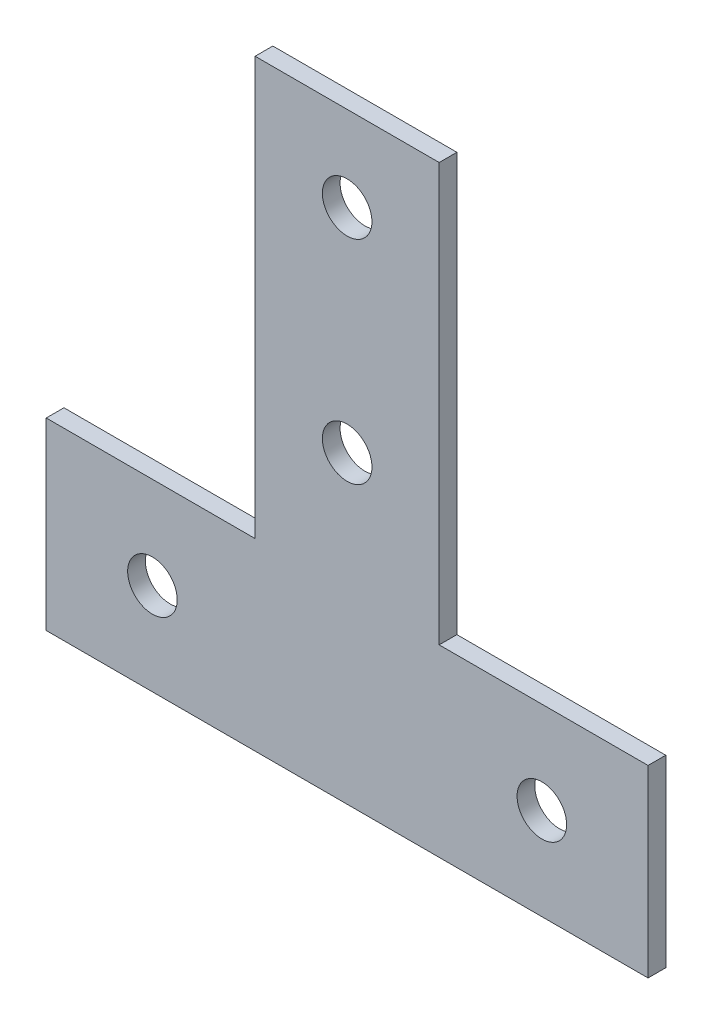
ISO-10303-21;
HEADER;
FILE_DESCRIPTION(('STEP AP214'),'2;1');
FILE_NAME('part.step','',(''),(''),'','','');
FILE_SCHEMA(('AUTOMOTIVE_DESIGN { 1 0 10303 214 1 1 1 1 }'));
ENDSEC;
DATA;
#1=APPLICATION_CONTEXT('core data for automotive mechanical design processes');
#2=APPLICATION_PROTOCOL_DEFINITION('international standard','automotive_design',2000,#1);
#3=PRODUCT_CONTEXT('',#1,'mechanical');
#4=PRODUCT('Part','Part','',(#3));
#5=PRODUCT_RELATED_PRODUCT_CATEGORY('part','',(#4));
#6=PRODUCT_DEFINITION_FORMATION('','',#4);
#7=PRODUCT_DEFINITION_CONTEXT('part definition',#1,'design');
#8=PRODUCT_DEFINITION('design','',#6,#7);
#9=PRODUCT_DEFINITION_SHAPE('','',#8);
#10=(LENGTH_UNIT() NAMED_UNIT(*) SI_UNIT(.MILLI.,.METRE.));
#11=(NAMED_UNIT(*) PLANE_ANGLE_UNIT() SI_UNIT($,.RADIAN.));
#12=(NAMED_UNIT(*) SI_UNIT($,.STERADIAN.) SOLID_ANGLE_UNIT());
#13=UNCERTAINTY_MEASURE_WITH_UNIT(LENGTH_MEASURE(1.E-05),#10,'distance_accuracy_value','');
#14=(GEOMETRIC_REPRESENTATION_CONTEXT(3) GLOBAL_UNCERTAINTY_ASSIGNED_CONTEXT((#13)) GLOBAL_UNIT_ASSIGNED_CONTEXT((#10,
#11,#12)) REPRESENTATION_CONTEXT('',''));
#15=CARTESIAN_POINT('',(0.,0.,0.));
#16=DIRECTION('',(0.,0.,1.));
#17=DIRECTION('',(1.,0.,0.));
#18=AXIS2_PLACEMENT_3D('',#15,#16,#17);
#19=CARTESIAN_POINT('',(0.,0.,2.5));
#20=DIRECTION('',(0.,0.,1.));
#21=DIRECTION('',(1.,0.,0.));
#22=AXIS2_PLACEMENT_3D('',#19,#20,#21);
#23=PLANE('',#22);
#24=CARTESIAN_POINT('',(-27.5,13.,2.5));
#25=DIRECTION('',(0.,0.,1.));
#26=DIRECTION('',(1.,0.,0.));
#27=AXIS2_PLACEMENT_3D('',#24,#25,#26);
#28=CIRCLE('',#27,3.5);
#29=CARTESIAN_POINT('',(-24.,13.,2.5));
#30=VERTEX_POINT('',#29);
#31=EDGE_CURVE('E189',#30,#30,#28,.T.);
#32=ORIENTED_EDGE('',*,*,#31,.F.);
#33=EDGE_LOOP('',(#32));
#34=FACE_BOUND('',#33,.T.);
#35=CARTESIAN_POINT('',(0.,73.,2.5));
#36=DIRECTION('',(0.,0.,1.));
#37=DIRECTION('',(1.,0.,0.));
#38=AXIS2_PLACEMENT_3D('',#35,#36,#37);
#39=CIRCLE('',#38,3.5);
#40=CARTESIAN_POINT('',(3.5,73.,2.5));
#41=VERTEX_POINT('',#40);
#42=EDGE_CURVE('E135',#41,#41,#39,.T.);
#43=ORIENTED_EDGE('',*,*,#42,.F.);
#44=EDGE_LOOP('',(#43));
#45=FACE_BOUND('',#44,.T.);
#46=DIRECTION('',(0.,1.,0.));
#47=VECTOR('',#46,1.);
#48=CARTESIAN_POINT('',(42.5,26.,2.5));
#49=LINE('',#48,#47);
#50=CARTESIAN_POINT('',(42.5,0.,2.5));
#51=VERTEX_POINT('',#50);
#52=CARTESIAN_POINT('',(42.5,26.,2.5));
#53=VERTEX_POINT('',#52);
#54=EDGE_CURVE('E146',#51,#53,#49,.T.);
#55=ORIENTED_EDGE('',*,*,#54,.T.);
#56=DIRECTION('',(-1.,0.,0.));
#57=VECTOR('',#56,1.);
#58=CARTESIAN_POINT('',(13.,26.,2.5));
#59=LINE('',#58,#57);
#60=CARTESIAN_POINT('',(13.,26.,2.5));
#61=VERTEX_POINT('',#60);
#62=EDGE_CURVE('E94',#53,#61,#59,.T.);
#63=ORIENTED_EDGE('',*,*,#62,.T.);
#64=DIRECTION('',(0.,1.,0.));
#65=VECTOR('',#64,1.);
#66=CARTESIAN_POINT('',(13.,85.,2.5));
#67=LINE('',#66,#65);
#68=CARTESIAN_POINT('',(13.,85.,2.5));
#69=VERTEX_POINT('',#68);
#70=EDGE_CURVE('E161',#61,#69,#67,.T.);
#71=ORIENTED_EDGE('',*,*,#70,.T.);
#72=DIRECTION('',(-1.,0.,0.));
#73=VECTOR('',#72,1.);
#74=CARTESIAN_POINT('',(-13.,85.,2.5));
#75=LINE('',#74,#73);
#76=CARTESIAN_POINT('',(-13.,85.,2.5));
#77=VERTEX_POINT('',#76);
#78=EDGE_CURVE('E174',#69,#77,#75,.T.);
#79=ORIENTED_EDGE('',*,*,#78,.T.);
#80=DIRECTION('',(0.,-1.,0.));
#81=VECTOR('',#80,1.);
#82=CARTESIAN_POINT('',(-13.,26.,2.5));
#83=LINE('',#82,#81);
#84=CARTESIAN_POINT('',(-13.,26.,2.5));
#85=VERTEX_POINT('',#84);
#86=EDGE_CURVE('E113',#77,#85,#83,.T.);
#87=ORIENTED_EDGE('',*,*,#86,.T.);
#88=DIRECTION('',(-1.,0.,0.));
#89=VECTOR('',#88,1.);
#90=CARTESIAN_POINT('',(-42.5,26.,2.5));
#91=LINE('',#90,#89);
#92=CARTESIAN_POINT('',(-42.5,26.,2.5));
#93=VERTEX_POINT('',#92);
#94=EDGE_CURVE('E107',#85,#93,#91,.T.);
#95=ORIENTED_EDGE('',*,*,#94,.T.);
#96=DIRECTION('',(0.,-1.,0.));
#97=VECTOR('',#96,1.);
#98=CARTESIAN_POINT('',(-42.5,0.,2.5));
#99=LINE('',#98,#97);
#100=CARTESIAN_POINT('',(-42.5,0.,2.5));
#101=VERTEX_POINT('',#100);
#102=EDGE_CURVE('E111',#93,#101,#99,.T.);
#103=ORIENTED_EDGE('',*,*,#102,.T.);
#104=DIRECTION('',(1.,0.,0.));
#105=VECTOR('',#104,1.);
#106=CARTESIAN_POINT('',(-42.5,0.,2.5));
#107=LINE('',#106,#105);
#108=EDGE_CURVE('E51',#101,#51,#107,.T.);
#109=ORIENTED_EDGE('',*,*,#108,.T.);
#110=EDGE_LOOP('',(#55,#63,#71,#79,#87,#95,#103,#109));
#111=FACE_BOUND('',#110,.T.);
#112=CARTESIAN_POINT('',(0.,43.,2.5));
#113=DIRECTION('',(0.,0.,1.));
#114=DIRECTION('',(1.,0.,0.));
#115=AXIS2_PLACEMENT_3D('',#112,#113,#114);
#116=CIRCLE('',#115,3.5);
#117=CARTESIAN_POINT('',(3.5,43.,2.5));
#118=VERTEX_POINT('',#117);
#119=EDGE_CURVE('E183',#118,#118,#116,.T.);
#120=ORIENTED_EDGE('',*,*,#119,.F.);
#121=EDGE_LOOP('',(#120));
#122=FACE_BOUND('',#121,.T.);
#123=CARTESIAN_POINT('',(27.5,13.,2.5));
#124=DIRECTION('',(0.,0.,1.));
#125=DIRECTION('',(1.,0.,0.));
#126=AXIS2_PLACEMENT_3D('',#123,#124,#125);
#127=CIRCLE('',#126,3.5);
#128=CARTESIAN_POINT('',(31.,13.,2.5));
#129=VERTEX_POINT('',#128);
#130=EDGE_CURVE('E195',#129,#129,#127,.T.);
#131=ORIENTED_EDGE('',*,*,#130,.F.);
#132=EDGE_LOOP('',(#131));
#133=FACE_BOUND('',#132,.T.);
#134=ADVANCED_FACE('F34',(#34,#45,#111,#122,#133),#23,.T.);
#135=CARTESIAN_POINT('',(0.,0.,0.));
#136=DIRECTION('',(0.,0.,1.));
#137=DIRECTION('',(1.,0.,0.));
#138=AXIS2_PLACEMENT_3D('',#135,#136,#137);
#139=PLANE('',#138);
#140=DIRECTION('',(0.,1.,0.));
#141=VECTOR('',#140,1.);
#142=CARTESIAN_POINT('',(42.5,26.,0.));
#143=LINE('',#142,#141);
#144=CARTESIAN_POINT('',(42.5,0.,0.));
#145=VERTEX_POINT('',#144);
#146=CARTESIAN_POINT('',(42.5,26.,0.));
#147=VERTEX_POINT('',#146);
#148=EDGE_CURVE('E131',#145,#147,#143,.T.);
#149=ORIENTED_EDGE('',*,*,#148,.F.);
#150=DIRECTION('',(1.,0.,0.));
#151=VECTOR('',#150,1.);
#152=CARTESIAN_POINT('',(-42.5,0.,0.));
#153=LINE('',#152,#151);
#154=CARTESIAN_POINT('',(-42.5,0.,0.));
#155=VERTEX_POINT('',#154);
#156=EDGE_CURVE('E86',#155,#145,#153,.T.);
#157=ORIENTED_EDGE('',*,*,#156,.F.);
#158=DIRECTION('',(0.,-1.,0.));
#159=VECTOR('',#158,1.);
#160=CARTESIAN_POINT('',(-42.5,0.,0.));
#161=LINE('',#160,#159);
#162=CARTESIAN_POINT('',(-42.5,26.,0.));
#163=VERTEX_POINT('',#162);
#164=EDGE_CURVE('E80',#163,#155,#161,.T.);
#165=ORIENTED_EDGE('',*,*,#164,.F.);
#166=DIRECTION('',(-1.,0.,0.));
#167=VECTOR('',#166,1.);
#168=CARTESIAN_POINT('',(-42.5,26.,0.));
#169=LINE('',#168,#167);
#170=CARTESIAN_POINT('',(-13.,26.,0.));
#171=VERTEX_POINT('',#170);
#172=EDGE_CURVE('E121',#171,#163,#169,.T.);
#173=ORIENTED_EDGE('',*,*,#172,.F.);
#174=DIRECTION('',(0.,-1.,0.));
#175=VECTOR('',#174,1.);
#176=CARTESIAN_POINT('',(-13.,26.,0.));
#177=LINE('',#176,#175);
#178=CARTESIAN_POINT('',(-13.,85.,0.));
#179=VERTEX_POINT('',#178);
#180=EDGE_CURVE('E141',#179,#171,#177,.T.);
#181=ORIENTED_EDGE('',*,*,#180,.F.);
#182=DIRECTION('',(-1.,0.,0.));
#183=VECTOR('',#182,1.);
#184=CARTESIAN_POINT('',(-13.,85.,0.));
#185=LINE('',#184,#183);
#186=CARTESIAN_POINT('',(13.,85.,0.));
#187=VERTEX_POINT('',#186);
#188=EDGE_CURVE('E139',#187,#179,#185,.T.);
#189=ORIENTED_EDGE('',*,*,#188,.F.);
#190=DIRECTION('',(0.,1.,0.));
#191=VECTOR('',#190,1.);
#192=CARTESIAN_POINT('',(13.,85.,0.));
#193=LINE('',#192,#191);
#194=CARTESIAN_POINT('',(13.,26.,0.));
#195=VERTEX_POINT('',#194);
#196=EDGE_CURVE('E137',#195,#187,#193,.T.);
#197=ORIENTED_EDGE('',*,*,#196,.F.);
#198=DIRECTION('',(-1.,0.,0.));
#199=VECTOR('',#198,1.);
#200=CARTESIAN_POINT('',(13.,26.,0.));
#201=LINE('',#200,#199);
#202=EDGE_CURVE('E134',#147,#195,#201,.T.);
#203=ORIENTED_EDGE('',*,*,#202,.F.);
#204=EDGE_LOOP('',(#149,#157,#165,#173,#181,#189,#197,#203));
#205=FACE_BOUND('',#204,.T.);
#206=CARTESIAN_POINT('',(0.,73.,0.));
#207=DIRECTION('',(0.,0.,1.));
#208=DIRECTION('',(1.,0.,0.));
#209=AXIS2_PLACEMENT_3D('',#206,#207,#208);
#210=CIRCLE('',#209,3.5);
#211=CARTESIAN_POINT('',(3.5,73.,0.));
#212=VERTEX_POINT('',#211);
#213=EDGE_CURVE('E180',#212,#212,#210,.T.);
#214=ORIENTED_EDGE('',*,*,#213,.T.);
#215=EDGE_LOOP('',(#214));
#216=FACE_BOUND('',#215,.T.);
#217=CARTESIAN_POINT('',(0.,43.,0.));
#218=DIRECTION('',(0.,0.,1.));
#219=DIRECTION('',(1.,0.,0.));
#220=AXIS2_PLACEMENT_3D('',#217,#218,#219);
#221=CIRCLE('',#220,3.5);
#222=CARTESIAN_POINT('',(3.5,43.,0.));
#223=VERTEX_POINT('',#222);
#224=EDGE_CURVE('E186',#223,#223,#221,.T.);
#225=ORIENTED_EDGE('',*,*,#224,.T.);
#226=EDGE_LOOP('',(#225));
#227=FACE_BOUND('',#226,.T.);
#228=CARTESIAN_POINT('',(-27.5,13.,0.));
#229=DIRECTION('',(0.,0.,1.));
#230=DIRECTION('',(1.,0.,0.));
#231=AXIS2_PLACEMENT_3D('',#228,#229,#230);
#232=CIRCLE('',#231,3.5);
#233=CARTESIAN_POINT('',(-24.,13.,0.));
#234=VERTEX_POINT('',#233);
#235=EDGE_CURVE('E192',#234,#234,#232,.T.);
#236=ORIENTED_EDGE('',*,*,#235,.T.);
#237=EDGE_LOOP('',(#236));
#238=FACE_BOUND('',#237,.T.);
#239=CARTESIAN_POINT('',(27.5,13.,0.));
#240=DIRECTION('',(0.,0.,1.));
#241=DIRECTION('',(1.,0.,0.));
#242=AXIS2_PLACEMENT_3D('',#239,#240,#241);
#243=CIRCLE('',#242,3.5);
#244=CARTESIAN_POINT('',(31.,13.,0.));
#245=VERTEX_POINT('',#244);
#246=EDGE_CURVE('E198',#245,#245,#243,.T.);
#247=ORIENTED_EDGE('',*,*,#246,.T.);
#248=EDGE_LOOP('',(#247));
#249=FACE_BOUND('',#248,.T.);
#250=ADVANCED_FACE('F165',(#205,#216,#227,#238,#249),#139,.F.);
#251=CARTESIAN_POINT('',(42.5,26.,2.5));
#252=DIRECTION('',(-1.,0.,0.));
#253=DIRECTION('',(0.,0.,1.));
#254=AXIS2_PLACEMENT_3D('',#251,#252,#253);
#255=PLANE('',#254);
#256=ORIENTED_EDGE('',*,*,#148,.T.);
#257=DIRECTION('',(0.,0.,-1.));
#258=VECTOR('',#257,1.);
#259=CARTESIAN_POINT('',(42.5,26.,2.5));
#260=LINE('',#259,#258);
#261=EDGE_CURVE('E11',#53,#147,#260,.T.);
#262=ORIENTED_EDGE('',*,*,#261,.F.);
#263=ORIENTED_EDGE('',*,*,#54,.F.);
#264=DIRECTION('',(0.,0.,-1.));
#265=VECTOR('',#264,1.);
#266=CARTESIAN_POINT('',(42.5,0.,2.5));
#267=LINE('',#266,#265);
#268=EDGE_CURVE('E127',#51,#145,#267,.T.);
#269=ORIENTED_EDGE('',*,*,#268,.T.);
#270=EDGE_LOOP('',(#256,#262,#263,#269));
#271=FACE_BOUND('',#270,.T.);
#272=ADVANCED_FACE('F36',(#271),#255,.F.);
#273=CARTESIAN_POINT('',(13.,26.,2.5));
#274=DIRECTION('',(0.,-1.,0.));
#275=DIRECTION('',(0.,0.,-1.));
#276=AXIS2_PLACEMENT_3D('',#273,#274,#275);
#277=PLANE('',#276);
#278=ORIENTED_EDGE('',*,*,#202,.T.);
#279=DIRECTION('',(0.,0.,-1.));
#280=VECTOR('',#279,1.);
#281=CARTESIAN_POINT('',(13.,26.,2.5));
#282=LINE('',#281,#280);
#283=EDGE_CURVE('E43',#61,#195,#282,.T.);
#284=ORIENTED_EDGE('',*,*,#283,.F.);
#285=ORIENTED_EDGE('',*,*,#62,.F.);
#286=ORIENTED_EDGE('',*,*,#261,.T.);
#287=EDGE_LOOP('',(#278,#284,#285,#286));
#288=FACE_BOUND('',#287,.T.);
#289=ADVANCED_FACE('F232',(#288),#277,.F.);
#290=CARTESIAN_POINT('',(13.,85.,2.5));
#291=DIRECTION('',(-1.,0.,0.));
#292=DIRECTION('',(0.,-1.,0.));
#293=AXIS2_PLACEMENT_3D('',#290,#291,#292);
#294=PLANE('',#293);
#295=ORIENTED_EDGE('',*,*,#196,.T.);
#296=DIRECTION('',(0.,0.,-1.));
#297=VECTOR('',#296,1.);
#298=CARTESIAN_POINT('',(13.,85.,2.5));
#299=LINE('',#298,#297);
#300=EDGE_CURVE('E153',#69,#187,#299,.T.);
#301=ORIENTED_EDGE('',*,*,#300,.F.);
#302=ORIENTED_EDGE('',*,*,#70,.F.);
#303=ORIENTED_EDGE('',*,*,#283,.T.);
#304=EDGE_LOOP('',(#295,#301,#302,#303));
#305=FACE_BOUND('',#304,.T.);
#306=ADVANCED_FACE('F159',(#305),#294,.F.);
#307=CARTESIAN_POINT('',(-13.,85.,2.5));
#308=DIRECTION('',(0.,-1.,0.));
#309=DIRECTION('',(0.,0.,-1.));
#310=AXIS2_PLACEMENT_3D('',#307,#308,#309);
#311=PLANE('',#310);
#312=ORIENTED_EDGE('',*,*,#188,.T.);
#313=DIRECTION('',(0.,0.,-1.));
#314=VECTOR('',#313,1.);
#315=CARTESIAN_POINT('',(-13.,85.,2.5));
#316=LINE('',#315,#314);
#317=EDGE_CURVE('E150',#77,#179,#316,.T.);
#318=ORIENTED_EDGE('',*,*,#317,.F.);
#319=ORIENTED_EDGE('',*,*,#78,.F.);
#320=ORIENTED_EDGE('',*,*,#300,.T.);
#321=EDGE_LOOP('',(#312,#318,#319,#320));
#322=FACE_BOUND('',#321,.T.);
#323=ADVANCED_FACE('F170',(#322),#311,.F.);
#324=CARTESIAN_POINT('',(-13.,26.,2.5));
#325=DIRECTION('',(1.,0.,0.));
#326=DIRECTION('',(0.,1.,0.));
#327=AXIS2_PLACEMENT_3D('',#324,#325,#326);
#328=PLANE('',#327);
#329=ORIENTED_EDGE('',*,*,#180,.T.);
#330=DIRECTION('',(0.,0.,-1.));
#331=VECTOR('',#330,1.);
#332=CARTESIAN_POINT('',(-13.,26.,2.5));
#333=LINE('',#332,#331);
#334=EDGE_CURVE('E122',#85,#171,#333,.T.);
#335=ORIENTED_EDGE('',*,*,#334,.F.);
#336=ORIENTED_EDGE('',*,*,#86,.F.);
#337=ORIENTED_EDGE('',*,*,#317,.T.);
#338=EDGE_LOOP('',(#329,#335,#336,#337));
#339=FACE_BOUND('',#338,.T.);
#340=ADVANCED_FACE('F173',(#339),#328,.F.);
#341=CARTESIAN_POINT('',(-42.5,26.,2.5));
#342=DIRECTION('',(0.,-1.,0.));
#343=DIRECTION('',(1.,0.,0.));
#344=AXIS2_PLACEMENT_3D('',#341,#342,#343);
#345=PLANE('',#344);
#346=ORIENTED_EDGE('',*,*,#172,.T.);
#347=DIRECTION('',(0.,0.,-1.));
#348=VECTOR('',#347,1.);
#349=CARTESIAN_POINT('',(-42.5,26.,2.5));
#350=LINE('',#349,#348);
#351=EDGE_CURVE('E118',#93,#163,#350,.T.);
#352=ORIENTED_EDGE('',*,*,#351,.F.);
#353=ORIENTED_EDGE('',*,*,#94,.F.);
#354=ORIENTED_EDGE('',*,*,#334,.T.);
#355=EDGE_LOOP('',(#346,#352,#353,#354));
#356=FACE_BOUND('',#355,.T.);
#357=ADVANCED_FACE('F119',(#356),#345,.F.);
#358=CARTESIAN_POINT('',(-42.5,0.,2.5));
#359=DIRECTION('',(1.,0.,0.));
#360=DIRECTION('',(0.,0.,-1.));
#361=AXIS2_PLACEMENT_3D('',#358,#359,#360);
#362=PLANE('',#361);
#363=ORIENTED_EDGE('',*,*,#164,.T.);
#364=DIRECTION('',(0.,0.,-1.));
#365=VECTOR('',#364,1.);
#366=CARTESIAN_POINT('',(-42.5,0.,2.5));
#367=LINE('',#366,#365);
#368=EDGE_CURVE('E123',#101,#155,#367,.T.);
#369=ORIENTED_EDGE('',*,*,#368,.F.);
#370=ORIENTED_EDGE('',*,*,#102,.F.);
#371=ORIENTED_EDGE('',*,*,#351,.T.);
#372=EDGE_LOOP('',(#363,#369,#370,#371));
#373=FACE_BOUND('',#372,.T.);
#374=ADVANCED_FACE('F125',(#373),#362,.F.);
#375=CARTESIAN_POINT('',(-42.5,0.,2.5));
#376=DIRECTION('',(0.,1.,0.));
#377=DIRECTION('',(-1.,0.,0.));
#378=AXIS2_PLACEMENT_3D('',#375,#376,#377);
#379=PLANE('',#378);
#380=ORIENTED_EDGE('',*,*,#156,.T.);
#381=ORIENTED_EDGE('',*,*,#268,.F.);
#382=ORIENTED_EDGE('',*,*,#108,.F.);
#383=ORIENTED_EDGE('',*,*,#368,.T.);
#384=EDGE_LOOP('',(#380,#381,#382,#383));
#385=FACE_BOUND('',#384,.T.);
#386=ADVANCED_FACE('F220',(#385),#379,.F.);
#387=CARTESIAN_POINT('',(0.,73.,2.5));
#388=DIRECTION('',(0.,0.,-1.));
#389=DIRECTION('',(-1.,0.,0.));
#390=AXIS2_PLACEMENT_3D('',#387,#388,#389);
#391=CYLINDRICAL_SURFACE('',#390,3.5);
#392=ORIENTED_EDGE('',*,*,#42,.T.);
#393=EDGE_LOOP('',(#392));
#394=FACE_BOUND('',#393,.T.);
#395=ORIENTED_EDGE('',*,*,#213,.F.);
#396=EDGE_LOOP('',(#395));
#397=FACE_BOUND('',#396,.T.);
#398=ADVANCED_FACE('F217',(#394,#397),#391,.F.);
#399=CARTESIAN_POINT('',(0.,43.,2.5));
#400=DIRECTION('',(0.,0.,-1.));
#401=DIRECTION('',(-1.,0.,0.));
#402=AXIS2_PLACEMENT_3D('',#399,#400,#401);
#403=CYLINDRICAL_SURFACE('',#402,3.5);
#404=ORIENTED_EDGE('',*,*,#119,.T.);
#405=EDGE_LOOP('',(#404));
#406=FACE_BOUND('',#405,.T.);
#407=ORIENTED_EDGE('',*,*,#224,.F.);
#408=EDGE_LOOP('',(#407));
#409=FACE_BOUND('',#408,.T.);
#410=ADVANCED_FACE('F296',(#406,#409),#403,.F.);
#411=CARTESIAN_POINT('',(-27.5,13.,2.5));
#412=DIRECTION('',(0.,0.,-1.));
#413=DIRECTION('',(-1.,0.,0.));
#414=AXIS2_PLACEMENT_3D('',#411,#412,#413);
#415=CYLINDRICAL_SURFACE('',#414,3.5);
#416=ORIENTED_EDGE('',*,*,#31,.T.);
#417=EDGE_LOOP('',(#416));
#418=FACE_BOUND('',#417,.T.);
#419=ORIENTED_EDGE('',*,*,#235,.F.);
#420=EDGE_LOOP('',(#419));
#421=FACE_BOUND('',#420,.T.);
#422=ADVANCED_FACE('F304',(#418,#421),#415,.F.);
#423=CARTESIAN_POINT('',(27.5,13.,2.5));
#424=DIRECTION('',(0.,0.,-1.));
#425=DIRECTION('',(-1.,0.,0.));
#426=AXIS2_PLACEMENT_3D('',#423,#424,#425);
#427=CYLINDRICAL_SURFACE('',#426,3.5);
#428=ORIENTED_EDGE('',*,*,#130,.T.);
#429=EDGE_LOOP('',(#428));
#430=FACE_BOUND('',#429,.T.);
#431=ORIENTED_EDGE('',*,*,#246,.F.);
#432=EDGE_LOOP('',(#431));
#433=FACE_BOUND('',#432,.T.);
#434=ADVANCED_FACE('F204',(#430,#433),#427,.F.);
#435=CLOSED_SHELL('',(#134,#250,#272,#289,#306,#323,#340,#357,#374,#386,#398,#410,#422,#434));
#436=MANIFOLD_SOLID_BREP('B2',#435);
#437=ADVANCED_BREP_SHAPE_REPRESENTATION('',(#18,#436),#14);
#438=SHAPE_DEFINITION_REPRESENTATION(#9,#437);
ENDSEC;
END-ISO-10303-21;
